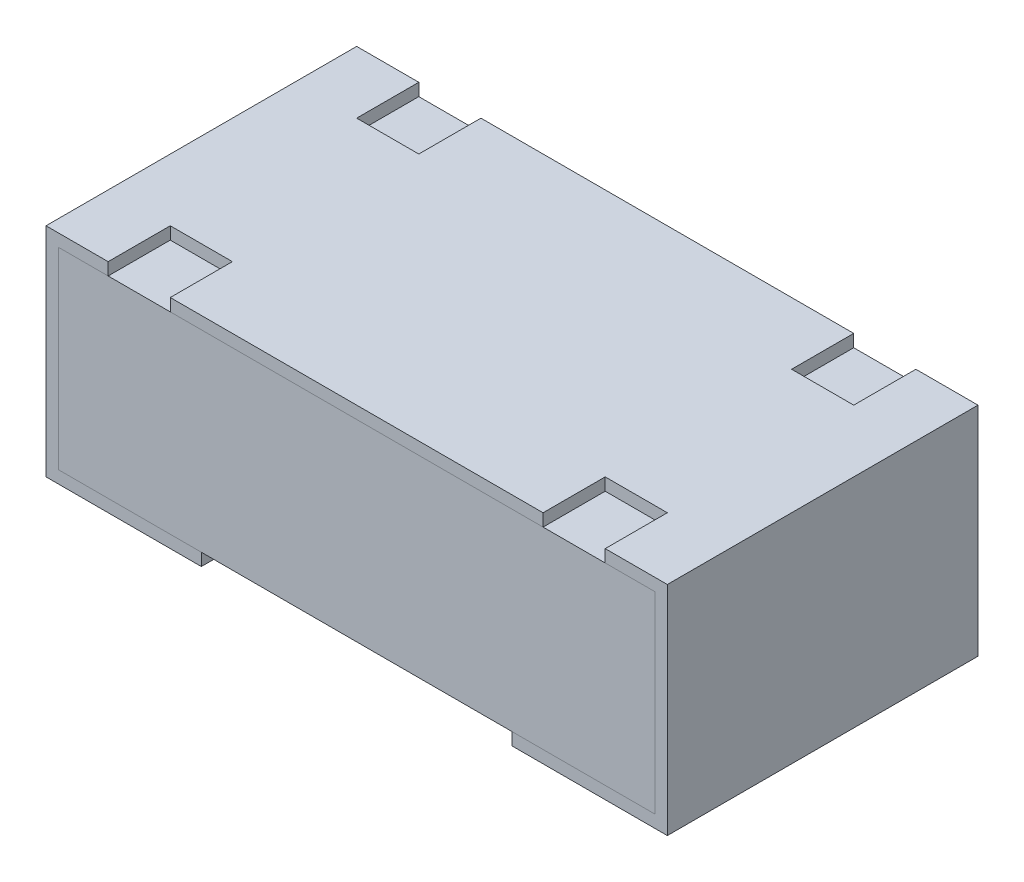
ISO-10303-21;
HEADER;
FILE_DESCRIPTION(('STEP AP214'),'2;1');
FILE_NAME('part.step','',(''),(''),'','','');
FILE_SCHEMA(('AUTOMOTIVE_DESIGN { 1 0 10303 214 1 1 1 1 }'));
ENDSEC;
DATA;
#1=APPLICATION_CONTEXT('core data for automotive mechanical design processes');
#2=APPLICATION_PROTOCOL_DEFINITION('international standard','automotive_design',2000,#1);
#3=PRODUCT_CONTEXT('',#1,'mechanical');
#4=PRODUCT('Part','Part','',(#3));
#5=PRODUCT_RELATED_PRODUCT_CATEGORY('part','',(#4));
#6=PRODUCT_DEFINITION_FORMATION('','',#4);
#7=PRODUCT_DEFINITION_CONTEXT('part definition',#1,'design');
#8=PRODUCT_DEFINITION('design','',#6,#7);
#9=PRODUCT_DEFINITION_SHAPE('','',#8);
#10=(LENGTH_UNIT() NAMED_UNIT(*) SI_UNIT(.MILLI.,.METRE.));
#11=(NAMED_UNIT(*) PLANE_ANGLE_UNIT() SI_UNIT($,.RADIAN.));
#12=(NAMED_UNIT(*) SI_UNIT($,.STERADIAN.) SOLID_ANGLE_UNIT());
#13=UNCERTAINTY_MEASURE_WITH_UNIT(LENGTH_MEASURE(1.E-05),#10,'distance_accuracy_value','');
#14=(GEOMETRIC_REPRESENTATION_CONTEXT(3) GLOBAL_UNCERTAINTY_ASSIGNED_CONTEXT((#13)) GLOBAL_UNIT_ASSIGNED_CONTEXT((#10,
#11,#12)) REPRESENTATION_CONTEXT('',''));
#15=CARTESIAN_POINT('',(0.,0.,0.));
#16=DIRECTION('',(0.,0.,1.));
#17=DIRECTION('',(1.,0.,0.));
#18=AXIS2_PLACEMENT_3D('',#15,#16,#17);
#19=CARTESIAN_POINT('',(-0.48,0.02,0.));
#20=DIRECTION('',(0.,0.,1.));
#21=DIRECTION('',(1.,0.,0.));
#22=AXIS2_PLACEMENT_3D('',#19,#20,#21);
#23=PLANE('',#22);
#24=DIRECTION('',(0.,-1.,0.));
#25=VECTOR('',#24,1.);
#26=CARTESIAN_POINT('',(-0.48,0.33,0.));
#27=LINE('',#26,#25);
#28=CARTESIAN_POINT('',(-0.48,0.33,0.));
#29=VERTEX_POINT('',#28);
#30=CARTESIAN_POINT('',(-0.48,0.02,0.));
#31=VERTEX_POINT('',#30);
#32=EDGE_CURVE('P0_E80',#29,#31,#27,.T.);
#33=ORIENTED_EDGE('',*,*,#32,.F.);
#34=DIRECTION('',(-1.,0.,0.));
#35=VECTOR('',#34,1.);
#36=CARTESIAN_POINT('',(-0.48,0.33,0.));
#37=LINE('',#36,#35);
#38=CARTESIAN_POINT('',(0.48,0.33,0.));
#39=VERTEX_POINT('',#38);
#40=EDGE_CURVE('P0_E26',#39,#29,#37,.T.);
#41=ORIENTED_EDGE('',*,*,#40,.F.);
#42=DIRECTION('',(0.,1.,0.));
#43=VECTOR('',#42,1.);
#44=CARTESIAN_POINT('',(0.48,0.33,0.));
#45=LINE('',#44,#43);
#46=CARTESIAN_POINT('',(0.48,0.02,0.));
#47=VERTEX_POINT('',#46);
#48=EDGE_CURVE('P0_E99',#47,#39,#45,.T.);
#49=ORIENTED_EDGE('',*,*,#48,.F.);
#50=DIRECTION('',(1.,0.,0.));
#51=VECTOR('',#50,1.);
#52=CARTESIAN_POINT('',(-0.48,0.02,0.));
#53=LINE('',#52,#51);
#54=EDGE_CURVE('P0_E84',#31,#47,#53,.T.);
#55=ORIENTED_EDGE('',*,*,#54,.F.);
#56=EDGE_LOOP('',(#33,#41,#49,#55));
#57=FACE_BOUND('',#56,.T.);
#58=ADVANCED_FACE('P0_F17',(#57),#23,.F.);
#59=CARTESIAN_POINT('',(-0.48,0.02,0.5));
#60=DIRECTION('',(0.,0.,1.));
#61=DIRECTION('',(1.,0.,0.));
#62=AXIS2_PLACEMENT_3D('',#59,#60,#61);
#63=PLANE('',#62);
#64=DIRECTION('',(0.,-1.,0.));
#65=VECTOR('',#64,1.);
#66=CARTESIAN_POINT('',(-0.48,0.33,0.5));
#67=LINE('',#66,#65);
#68=CARTESIAN_POINT('',(-0.48,0.33,0.5));
#69=VERTEX_POINT('',#68);
#70=CARTESIAN_POINT('',(-0.48,0.02,0.5));
#71=VERTEX_POINT('',#70);
#72=EDGE_CURVE('P0_E82',#69,#71,#67,.T.);
#73=ORIENTED_EDGE('',*,*,#72,.T.);
#74=DIRECTION('',(1.,0.,0.));
#75=VECTOR('',#74,1.);
#76=CARTESIAN_POINT('',(-0.48,0.02,0.5));
#77=LINE('',#76,#75);
#78=CARTESIAN_POINT('',(0.48,0.02,0.5));
#79=VERTEX_POINT('',#78);
#80=EDGE_CURVE('P0_E102',#71,#79,#77,.T.);
#81=ORIENTED_EDGE('',*,*,#80,.T.);
#82=DIRECTION('',(0.,1.,0.));
#83=VECTOR('',#82,1.);
#84=CARTESIAN_POINT('',(0.48,0.33,0.5));
#85=LINE('',#84,#83);
#86=CARTESIAN_POINT('',(0.48,0.33,0.5));
#87=VERTEX_POINT('',#86);
#88=EDGE_CURVE('P0_E75',#79,#87,#85,.T.);
#89=ORIENTED_EDGE('',*,*,#88,.T.);
#90=DIRECTION('',(-1.,0.,0.));
#91=VECTOR('',#90,1.);
#92=CARTESIAN_POINT('',(-0.48,0.33,0.5));
#93=LINE('',#92,#91);
#94=EDGE_CURVE('P0_E11',#87,#69,#93,.T.);
#95=ORIENTED_EDGE('',*,*,#94,.T.);
#96=EDGE_LOOP('',(#73,#81,#89,#95));
#97=FACE_BOUND('',#96,.T.);
#98=ADVANCED_FACE('P0_F19',(#97),#63,.T.);
#99=CARTESIAN_POINT('',(-0.48,0.33,0.5));
#100=DIRECTION('',(0.,-1.,0.));
#101=DIRECTION('',(0.,0.,-1.));
#102=AXIS2_PLACEMENT_3D('',#99,#100,#101);
#103=PLANE('',#102);
#104=ORIENTED_EDGE('',*,*,#40,.T.);
#105=DIRECTION('',(0.,0.,-1.));
#106=VECTOR('',#105,1.);
#107=CARTESIAN_POINT('',(-0.48,0.33,0.5));
#108=LINE('',#107,#106);
#109=EDGE_CURVE('P0_E69',#69,#29,#108,.T.);
#110=ORIENTED_EDGE('',*,*,#109,.F.);
#111=ORIENTED_EDGE('',*,*,#94,.F.);
#112=DIRECTION('',(0.,0.,-1.));
#113=VECTOR('',#112,1.);
#114=CARTESIAN_POINT('',(0.48,0.33,0.5));
#115=LINE('',#114,#113);
#116=EDGE_CURVE('P0_E72',#87,#39,#115,.T.);
#117=ORIENTED_EDGE('',*,*,#116,.T.);
#118=EDGE_LOOP('',(#104,#110,#111,#117));
#119=FACE_BOUND('',#118,.T.);
#120=ADVANCED_FACE('P0_F68',(#119),#103,.F.);
#121=CARTESIAN_POINT('',(0.48,0.33,0.5));
#122=DIRECTION('',(-1.,0.,0.));
#123=DIRECTION('',(0.,0.,1.));
#124=AXIS2_PLACEMENT_3D('',#121,#122,#123);
#125=PLANE('',#124);
#126=ORIENTED_EDGE('',*,*,#48,.T.);
#127=ORIENTED_EDGE('',*,*,#116,.F.);
#128=ORIENTED_EDGE('',*,*,#88,.F.);
#129=DIRECTION('',(0.,0.,-1.));
#130=VECTOR('',#129,1.);
#131=CARTESIAN_POINT('',(0.48,0.02,0.5));
#132=LINE('',#131,#130);
#133=EDGE_CURVE('P0_E105',#79,#47,#132,.T.);
#134=ORIENTED_EDGE('',*,*,#133,.T.);
#135=EDGE_LOOP('',(#126,#127,#128,#134));
#136=FACE_BOUND('',#135,.T.);
#137=ADVANCED_FACE('P0_F120',(#136),#125,.F.);
#138=CARTESIAN_POINT('',(-0.48,0.02,0.5));
#139=DIRECTION('',(0.,1.,0.));
#140=DIRECTION('',(1.,0.,0.));
#141=AXIS2_PLACEMENT_3D('',#138,#139,#140);
#142=PLANE('',#141);
#143=ORIENTED_EDGE('',*,*,#54,.T.);
#144=ORIENTED_EDGE('',*,*,#133,.F.);
#145=ORIENTED_EDGE('',*,*,#80,.F.);
#146=DIRECTION('',(0.,0.,-1.));
#147=VECTOR('',#146,1.);
#148=CARTESIAN_POINT('',(-0.48,0.02,0.5));
#149=LINE('',#148,#147);
#150=EDGE_CURVE('P0_E89',#71,#31,#149,.T.);
#151=ORIENTED_EDGE('',*,*,#150,.T.);
#152=EDGE_LOOP('',(#143,#144,#145,#151));
#153=FACE_BOUND('',#152,.T.);
#154=ADVANCED_FACE('P0_F122',(#153),#142,.F.);
#155=CARTESIAN_POINT('',(-0.48,0.33,0.5));
#156=DIRECTION('',(1.,0.,0.));
#157=DIRECTION('',(0.,1.,0.));
#158=AXIS2_PLACEMENT_3D('',#155,#156,#157);
#159=PLANE('',#158);
#160=ORIENTED_EDGE('',*,*,#32,.T.);
#161=ORIENTED_EDGE('',*,*,#150,.F.);
#162=ORIENTED_EDGE('',*,*,#72,.F.);
#163=ORIENTED_EDGE('',*,*,#109,.T.);
#164=EDGE_LOOP('',(#160,#161,#162,#163));
#165=FACE_BOUND('',#164,.T.);
#166=ADVANCED_FACE('P0_F78',(#165),#159,.F.);
#167=CLOSED_SHELL('',(#58,#98,#120,#137,#154,#166));
#168=MANIFOLD_SOLID_BREP('P0_B1',#167);
#169=CARTESIAN_POINT('',(-0.3,0.33,0.5));
#170=DIRECTION('',(1.,0.,0.));
#171=DIRECTION('',(0.,1.,0.));
#172=AXIS2_PLACEMENT_3D('',#169,#170,#171);
#173=PLANE('',#172);
#174=DIRECTION('',(0.,0.,-1.));
#175=VECTOR('',#174,1.);
#176=CARTESIAN_POINT('',(-0.3,0.35,0.5));
#177=LINE('',#176,#175);
#178=CARTESIAN_POINT('',(-0.3,0.35,0.5));
#179=VERTEX_POINT('',#178);
#180=CARTESIAN_POINT('',(-0.3,0.35,0.4));
#181=VERTEX_POINT('',#180);
#182=EDGE_CURVE('P1_E271',#179,#181,#177,.T.);
#183=ORIENTED_EDGE('',*,*,#182,.T.);
#184=DIRECTION('',(0.,1.,0.));
#185=VECTOR('',#184,1.);
#186=CARTESIAN_POINT('',(-0.3,0.33,0.4));
#187=LINE('',#186,#185);
#188=CARTESIAN_POINT('',(-0.3,0.33,0.4));
#189=VERTEX_POINT('',#188);
#190=EDGE_CURVE('P1_E11',#189,#181,#187,.T.);
#191=ORIENTED_EDGE('',*,*,#190,.F.);
#192=DIRECTION('',(0.,0.,-1.));
#193=VECTOR('',#192,1.);
#194=CARTESIAN_POINT('',(-0.3,0.33,0.5));
#195=LINE('',#194,#193);
#196=CARTESIAN_POINT('',(-0.3,0.33,0.5));
#197=VERTEX_POINT('',#196);
#198=EDGE_CURVE('P1_E273',#197,#189,#195,.T.);
#199=ORIENTED_EDGE('',*,*,#198,.F.);
#200=DIRECTION('',(0.,1.,0.));
#201=VECTOR('',#200,1.);
#202=CARTESIAN_POINT('',(-0.3,0.33,0.5));
#203=LINE('',#202,#201);
#204=EDGE_CURVE('P1_E268',#197,#179,#203,.T.);
#205=ORIENTED_EDGE('',*,*,#204,.T.);
#206=EDGE_LOOP('',(#183,#191,#199,#205));
#207=FACE_BOUND('',#206,.T.);
#208=ADVANCED_FACE('P1_F17',(#207),#173,.F.);
#209=CARTESIAN_POINT('',(-0.3,0.33,0.4));
#210=DIRECTION('',(0.,0.,-1.));
#211=DIRECTION('',(0.,-1.,0.));
#212=AXIS2_PLACEMENT_3D('',#209,#210,#211);
#213=PLANE('',#212);
#214=DIRECTION('',(-1.,0.,0.));
#215=VECTOR('',#214,1.);
#216=CARTESIAN_POINT('',(-0.3,0.35,0.4));
#217=LINE('',#216,#215);
#218=CARTESIAN_POINT('',(-0.4,0.35,0.4));
#219=VERTEX_POINT('',#218);
#220=EDGE_CURVE('P1_E294',#181,#219,#217,.T.);
#221=ORIENTED_EDGE('',*,*,#220,.T.);
#222=DIRECTION('',(0.,1.,0.));
#223=VECTOR('',#222,1.);
#224=CARTESIAN_POINT('',(-0.4,0.33,0.4));
#225=LINE('',#224,#223);
#226=CARTESIAN_POINT('',(-0.4,0.33,0.4));
#227=VERTEX_POINT('',#226);
#228=EDGE_CURVE('P1_E26',#227,#219,#225,.T.);
#229=ORIENTED_EDGE('',*,*,#228,.F.);
#230=DIRECTION('',(-1.,0.,0.));
#231=VECTOR('',#230,1.);
#232=CARTESIAN_POINT('',(-0.3,0.33,0.4));
#233=LINE('',#232,#231);
#234=EDGE_CURVE('P1_E342',#189,#227,#233,.T.);
#235=ORIENTED_EDGE('',*,*,#234,.F.);
#236=ORIENTED_EDGE('',*,*,#190,.T.);
#237=EDGE_LOOP('',(#221,#229,#235,#236));
#238=FACE_BOUND('',#237,.T.);
#239=ADVANCED_FACE('P1_F870',(#238),#213,.F.);
#240=CARTESIAN_POINT('',(-0.4,0.33,0.4));
#241=DIRECTION('',(-1.,0.,0.));
#242=DIRECTION('',(0.,0.,1.));
#243=AXIS2_PLACEMENT_3D('',#240,#241,#242);
#244=PLANE('',#243);
#245=DIRECTION('',(0.,0.,1.));
#246=VECTOR('',#245,1.);
#247=CARTESIAN_POINT('',(-0.4,0.35,0.4));
#248=LINE('',#247,#246);
#249=CARTESIAN_POINT('',(-0.4,0.35,0.5));
#250=VERTEX_POINT('',#249);
#251=EDGE_CURVE('P1_E312',#219,#250,#248,.T.);
#252=ORIENTED_EDGE('',*,*,#251,.T.);
#253=DIRECTION('',(0.,1.,0.));
#254=VECTOR('',#253,1.);
#255=CARTESIAN_POINT('',(-0.4,0.33,0.5));
#256=LINE('',#255,#254);
#257=CARTESIAN_POINT('',(-0.4,0.33,0.5));
#258=VERTEX_POINT('',#257);
#259=EDGE_CURVE('P1_E208',#258,#250,#256,.T.);
#260=ORIENTED_EDGE('',*,*,#259,.F.);
#261=DIRECTION('',(0.,0.,1.));
#262=VECTOR('',#261,1.);
#263=CARTESIAN_POINT('',(-0.4,0.33,0.4));
#264=LINE('',#263,#262);
#265=EDGE_CURVE('P1_E346',#227,#258,#264,.T.);
#266=ORIENTED_EDGE('',*,*,#265,.F.);
#267=ORIENTED_EDGE('',*,*,#228,.T.);
#268=EDGE_LOOP('',(#252,#260,#266,#267));
#269=FACE_BOUND('',#268,.T.);
#270=ADVANCED_FACE('P1_F867',(#269),#244,.F.);
#271=CARTESIAN_POINT('',(0.4,0.33,0.4));
#272=DIRECTION('',(1.,0.,0.));
#273=DIRECTION('',(0.,0.,-1.));
#274=AXIS2_PLACEMENT_3D('',#271,#272,#273);
#275=PLANE('',#274);
#276=DIRECTION('',(0.,0.,-1.));
#277=VECTOR('',#276,1.);
#278=CARTESIAN_POINT('',(0.4,0.35,0.4));
#279=LINE('',#278,#277);
#280=CARTESIAN_POINT('',(0.4,0.35,0.5));
#281=VERTEX_POINT('',#280);
#282=CARTESIAN_POINT('',(0.4,0.35,0.4));
#283=VERTEX_POINT('',#282);
#284=EDGE_CURVE('P1_E454',#281,#283,#279,.T.);
#285=ORIENTED_EDGE('',*,*,#284,.T.);
#286=DIRECTION('',(0.,1.,0.));
#287=VECTOR('',#286,1.);
#288=CARTESIAN_POINT('',(0.4,0.33,0.4));
#289=LINE('',#288,#287);
#290=CARTESIAN_POINT('',(0.4,0.33,0.4));
#291=VERTEX_POINT('',#290);
#292=EDGE_CURVE('P1_E349',#291,#283,#289,.T.);
#293=ORIENTED_EDGE('',*,*,#292,.F.);
#294=DIRECTION('',(0.,0.,-1.));
#295=VECTOR('',#294,1.);
#296=CARTESIAN_POINT('',(0.4,0.33,0.4));
#297=LINE('',#296,#295);
#298=CARTESIAN_POINT('',(0.4,0.33,0.5));
#299=VERTEX_POINT('',#298);
#300=EDGE_CURVE('P1_E483',#299,#291,#297,.T.);
#301=ORIENTED_EDGE('',*,*,#300,.F.);
#302=DIRECTION('',(0.,1.,0.));
#303=VECTOR('',#302,1.);
#304=CARTESIAN_POINT('',(0.4,0.33,0.5));
#305=LINE('',#304,#303);
#306=EDGE_CURVE('P1_E504',#299,#281,#305,.T.);
#307=ORIENTED_EDGE('',*,*,#306,.T.);
#308=EDGE_LOOP('',(#285,#293,#301,#307));
#309=FACE_BOUND('',#308,.T.);
#310=ADVANCED_FACE('P1_F19',(#309),#275,.F.);
#311=CARTESIAN_POINT('',(0.3,0.33,0.4));
#312=DIRECTION('',(0.,0.,-1.));
#313=DIRECTION('',(0.,-1.,0.));
#314=AXIS2_PLACEMENT_3D('',#311,#312,#313);
#315=PLANE('',#314);
#316=DIRECTION('',(-1.,0.,0.));
#317=VECTOR('',#316,1.);
#318=CARTESIAN_POINT('',(0.3,0.35,0.4));
#319=LINE('',#318,#317);
#320=CARTESIAN_POINT('',(0.3,0.35,0.4));
#321=VERTEX_POINT('',#320);
#322=EDGE_CURVE('P1_E451',#283,#321,#319,.T.);
#323=ORIENTED_EDGE('',*,*,#322,.T.);
#324=DIRECTION('',(0.,1.,0.));
#325=VECTOR('',#324,1.);
#326=CARTESIAN_POINT('',(0.3,0.33,0.4));
#327=LINE('',#326,#325);
#328=CARTESIAN_POINT('',(0.3,0.33,0.4));
#329=VERTEX_POINT('',#328);
#330=EDGE_CURVE('P1_E176',#329,#321,#327,.T.);
#331=ORIENTED_EDGE('',*,*,#330,.F.);
#332=DIRECTION('',(-1.,0.,0.));
#333=VECTOR('',#332,1.);
#334=CARTESIAN_POINT('',(0.3,0.33,0.4));
#335=LINE('',#334,#333);
#336=EDGE_CURVE('P1_E485',#291,#329,#335,.T.);
#337=ORIENTED_EDGE('',*,*,#336,.F.);
#338=ORIENTED_EDGE('',*,*,#292,.T.);
#339=EDGE_LOOP('',(#323,#331,#337,#338));
#340=FACE_BOUND('',#339,.T.);
#341=ADVANCED_FACE('P1_F855',(#340),#315,.F.);
#342=CARTESIAN_POINT('',(0.3,0.33,0.5));
#343=DIRECTION('',(-1.,0.,0.));
#344=DIRECTION('',(0.,0.,1.));
#345=AXIS2_PLACEMENT_3D('',#342,#343,#344);
#346=PLANE('',#345);
#347=DIRECTION('',(0.,0.,1.));
#348=VECTOR('',#347,1.);
#349=CARTESIAN_POINT('',(0.3,0.35,0.5));
#350=LINE('',#349,#348);
#351=CARTESIAN_POINT('',(0.3,0.35,0.5));
#352=VERTEX_POINT('',#351);
#353=EDGE_CURVE('P1_E290',#321,#352,#350,.T.);
#354=ORIENTED_EDGE('',*,*,#353,.T.);
#355=DIRECTION('',(0.,1.,0.));
#356=VECTOR('',#355,1.);
#357=CARTESIAN_POINT('',(0.3,0.33,0.5));
#358=LINE('',#357,#356);
#359=CARTESIAN_POINT('',(0.3,0.33,0.5));
#360=VERTEX_POINT('',#359);
#361=EDGE_CURVE('P1_E285',#360,#352,#358,.T.);
#362=ORIENTED_EDGE('',*,*,#361,.F.);
#363=DIRECTION('',(0.,0.,1.));
#364=VECTOR('',#363,1.);
#365=CARTESIAN_POINT('',(0.3,0.33,0.5));
#366=LINE('',#365,#364);
#367=EDGE_CURVE('P1_E447',#329,#360,#366,.T.);
#368=ORIENTED_EDGE('',*,*,#367,.F.);
#369=ORIENTED_EDGE('',*,*,#330,.T.);
#370=EDGE_LOOP('',(#354,#362,#368,#369));
#371=FACE_BOUND('',#370,.T.);
#372=ADVANCED_FACE('P1_F858',(#371),#346,.F.);
#373=CARTESIAN_POINT('',(-0.4,0.33,0.1));
#374=DIRECTION('',(-1.,0.,0.));
#375=DIRECTION('',(0.,1.,0.));
#376=AXIS2_PLACEMENT_3D('',#373,#374,#375);
#377=PLANE('',#376);
#378=DIRECTION('',(0.,0.,1.));
#379=VECTOR('',#378,1.);
#380=CARTESIAN_POINT('',(-0.4,0.35,0.1));
#381=LINE('',#380,#379);
#382=CARTESIAN_POINT('',(-0.4,0.35,0.));
#383=VERTEX_POINT('',#382);
#384=CARTESIAN_POINT('',(-0.4,0.35,0.1));
#385=VERTEX_POINT('',#384);
#386=EDGE_CURVE('P1_E332',#383,#385,#381,.T.);
#387=ORIENTED_EDGE('',*,*,#386,.T.);
#388=DIRECTION('',(0.,1.,0.));
#389=VECTOR('',#388,1.);
#390=CARTESIAN_POINT('',(-0.4,0.33,0.1));
#391=LINE('',#390,#389);
#392=CARTESIAN_POINT('',(-0.4,0.33,0.1));
#393=VERTEX_POINT('',#392);
#394=EDGE_CURVE('P1_E350',#393,#385,#391,.T.);
#395=ORIENTED_EDGE('',*,*,#394,.F.);
#396=DIRECTION('',(0.,0.,1.));
#397=VECTOR('',#396,1.);
#398=CARTESIAN_POINT('',(-0.4,0.33,0.1));
#399=LINE('',#398,#397);
#400=CARTESIAN_POINT('',(-0.4,0.33,0.));
#401=VERTEX_POINT('',#400);
#402=EDGE_CURVE('P1_E427',#401,#393,#399,.T.);
#403=ORIENTED_EDGE('',*,*,#402,.F.);
#404=DIRECTION('',(0.,1.,0.));
#405=VECTOR('',#404,1.);
#406=CARTESIAN_POINT('',(-0.4,0.33,0.));
#407=LINE('',#406,#405);
#408=EDGE_CURVE('P1_E507',#401,#383,#407,.T.);
#409=ORIENTED_EDGE('',*,*,#408,.T.);
#410=EDGE_LOOP('',(#387,#395,#403,#409));
#411=FACE_BOUND('',#410,.T.);
#412=ADVANCED_FACE('P1_F864',(#411),#377,.F.);
#413=CARTESIAN_POINT('',(-0.3,0.33,0.1));
#414=DIRECTION('',(0.,0.,1.));
#415=DIRECTION('',(1.,0.,0.));
#416=AXIS2_PLACEMENT_3D('',#413,#414,#415);
#417=PLANE('',#416);
#418=DIRECTION('',(1.,0.,0.));
#419=VECTOR('',#418,1.);
#420=CARTESIAN_POINT('',(-0.3,0.35,0.1));
#421=LINE('',#420,#419);
#422=CARTESIAN_POINT('',(-0.3,0.35,0.1));
#423=VERTEX_POINT('',#422);
#424=EDGE_CURVE('P1_E322',#385,#423,#421,.T.);
#425=ORIENTED_EDGE('',*,*,#424,.T.);
#426=DIRECTION('',(0.,1.,0.));
#427=VECTOR('',#426,1.);
#428=CARTESIAN_POINT('',(-0.3,0.33,0.1));
#429=LINE('',#428,#427);
#430=CARTESIAN_POINT('',(-0.3,0.33,0.1));
#431=VERTEX_POINT('',#430);
#432=EDGE_CURVE('P1_E516',#431,#423,#429,.T.);
#433=ORIENTED_EDGE('',*,*,#432,.F.);
#434=DIRECTION('',(1.,0.,0.));
#435=VECTOR('',#434,1.);
#436=CARTESIAN_POINT('',(-0.3,0.33,0.1));
#437=LINE('',#436,#435);
#438=EDGE_CURVE('P1_E398',#393,#431,#437,.T.);
#439=ORIENTED_EDGE('',*,*,#438,.F.);
#440=ORIENTED_EDGE('',*,*,#394,.T.);
#441=EDGE_LOOP('',(#425,#433,#439,#440));
#442=FACE_BOUND('',#441,.T.);
#443=ADVANCED_FACE('P1_F622',(#442),#417,.F.);
#444=CARTESIAN_POINT('',(-0.3,0.33,0.));
#445=DIRECTION('',(1.,0.,0.));
#446=DIRECTION('',(0.,1.,0.));
#447=AXIS2_PLACEMENT_3D('',#444,#445,#446);
#448=PLANE('',#447);
#449=DIRECTION('',(0.,0.,-1.));
#450=VECTOR('',#449,1.);
#451=CARTESIAN_POINT('',(-0.3,0.35,0.));
#452=LINE('',#451,#450);
#453=CARTESIAN_POINT('',(-0.3,0.35,0.));
#454=VERTEX_POINT('',#453);
#455=EDGE_CURVE('P1_E296',#423,#454,#452,.T.);
#456=ORIENTED_EDGE('',*,*,#455,.T.);
#457=DIRECTION('',(0.,1.,0.));
#458=VECTOR('',#457,1.);
#459=CARTESIAN_POINT('',(-0.3,0.33,0.));
#460=LINE('',#459,#458);
#461=CARTESIAN_POINT('',(-0.3,0.33,0.));
#462=VERTEX_POINT('',#461);
#463=EDGE_CURVE('P1_E392',#462,#454,#460,.T.);
#464=ORIENTED_EDGE('',*,*,#463,.F.);
#465=DIRECTION('',(0.,0.,-1.));
#466=VECTOR('',#465,1.);
#467=CARTESIAN_POINT('',(-0.3,0.33,0.));
#468=LINE('',#467,#466);
#469=EDGE_CURVE('P1_E307',#431,#462,#468,.T.);
#470=ORIENTED_EDGE('',*,*,#469,.F.);
#471=ORIENTED_EDGE('',*,*,#432,.T.);
#472=EDGE_LOOP('',(#456,#464,#470,#471));
#473=FACE_BOUND('',#472,.T.);
#474=ADVANCED_FACE('P1_F625',(#473),#448,.F.);
#475=CARTESIAN_POINT('',(0.3,0.33,0.));
#476=DIRECTION('',(-1.,0.,0.));
#477=DIRECTION('',(0.,0.,1.));
#478=AXIS2_PLACEMENT_3D('',#475,#476,#477);
#479=PLANE('',#478);
#480=DIRECTION('',(0.,0.,1.));
#481=VECTOR('',#480,1.);
#482=CARTESIAN_POINT('',(0.3,0.35,0.));
#483=LINE('',#482,#481);
#484=CARTESIAN_POINT('',(0.3,0.35,0.));
#485=VERTEX_POINT('',#484);
#486=CARTESIAN_POINT('',(0.3,0.35,0.1));
#487=VERTEX_POINT('',#486);
#488=EDGE_CURVE('P1_E568',#485,#487,#483,.T.);
#489=ORIENTED_EDGE('',*,*,#488,.T.);
#490=DIRECTION('',(0.,1.,0.));
#491=VECTOR('',#490,1.);
#492=CARTESIAN_POINT('',(0.3,0.33,0.1));
#493=LINE('',#492,#491);
#494=CARTESIAN_POINT('',(0.3,0.33,0.1));
#495=VERTEX_POINT('',#494);
#496=EDGE_CURVE('P1_E513',#495,#487,#493,.T.);
#497=ORIENTED_EDGE('',*,*,#496,.F.);
#498=DIRECTION('',(0.,0.,1.));
#499=VECTOR('',#498,1.);
#500=CARTESIAN_POINT('',(0.3,0.33,0.));
#501=LINE('',#500,#499);
#502=CARTESIAN_POINT('',(0.3,0.33,0.));
#503=VERTEX_POINT('',#502);
#504=EDGE_CURVE('P1_E474',#503,#495,#501,.T.);
#505=ORIENTED_EDGE('',*,*,#504,.F.);
#506=DIRECTION('',(0.,1.,0.));
#507=VECTOR('',#506,1.);
#508=CARTESIAN_POINT('',(0.3,0.33,0.));
#509=LINE('',#508,#507);
#510=EDGE_CURVE('P1_E393',#503,#485,#509,.T.);
#511=ORIENTED_EDGE('',*,*,#510,.T.);
#512=EDGE_LOOP('',(#489,#497,#505,#511));
#513=FACE_BOUND('',#512,.T.);
#514=ADVANCED_FACE('P1_F887',(#513),#479,.F.);
#515=CARTESIAN_POINT('',(0.3,0.33,0.1));
#516=DIRECTION('',(0.,0.,1.));
#517=DIRECTION('',(1.,0.,0.));
#518=AXIS2_PLACEMENT_3D('',#515,#516,#517);
#519=PLANE('',#518);
#520=DIRECTION('',(1.,0.,0.));
#521=VECTOR('',#520,1.);
#522=CARTESIAN_POINT('',(0.3,0.35,0.1));
#523=LINE('',#522,#521);
#524=CARTESIAN_POINT('',(0.4,0.35,0.1));
#525=VERTEX_POINT('',#524);
#526=EDGE_CURVE('P1_E444',#487,#525,#523,.T.);
#527=ORIENTED_EDGE('',*,*,#526,.T.);
#528=DIRECTION('',(0.,1.,0.));
#529=VECTOR('',#528,1.);
#530=CARTESIAN_POINT('',(0.4,0.33,0.1));
#531=LINE('',#530,#529);
#532=CARTESIAN_POINT('',(0.4,0.33,0.1));
#533=VERTEX_POINT('',#532);
#534=EDGE_CURVE('P1_E510',#533,#525,#531,.T.);
#535=ORIENTED_EDGE('',*,*,#534,.F.);
#536=DIRECTION('',(1.,0.,0.));
#537=VECTOR('',#536,1.);
#538=CARTESIAN_POINT('',(0.3,0.33,0.1));
#539=LINE('',#538,#537);
#540=EDGE_CURVE('P1_E478',#495,#533,#539,.T.);
#541=ORIENTED_EDGE('',*,*,#540,.F.);
#542=ORIENTED_EDGE('',*,*,#496,.T.);
#543=EDGE_LOOP('',(#527,#535,#541,#542));
#544=FACE_BOUND('',#543,.T.);
#545=ADVANCED_FACE('P1_F835',(#544),#519,.F.);
#546=CARTESIAN_POINT('',(0.4,0.33,0.1));
#547=DIRECTION('',(1.,0.,0.));
#548=DIRECTION('',(0.,0.,1.));
#549=AXIS2_PLACEMENT_3D('',#546,#547,#548);
#550=PLANE('',#549);
#551=DIRECTION('',(0.,0.,-1.));
#552=VECTOR('',#551,1.);
#553=CARTESIAN_POINT('',(0.4,0.35,0.1));
#554=LINE('',#553,#552);
#555=CARTESIAN_POINT('',(0.4,0.35,0.));
#556=VERTEX_POINT('',#555);
#557=EDGE_CURVE('P1_E406',#525,#556,#554,.T.);
#558=ORIENTED_EDGE('',*,*,#557,.T.);
#559=DIRECTION('',(0.,1.,0.));
#560=VECTOR('',#559,1.);
#561=CARTESIAN_POINT('',(0.4,0.33,0.));
#562=LINE('',#561,#560);
#563=CARTESIAN_POINT('',(0.4,0.33,0.));
#564=VERTEX_POINT('',#563);
#565=EDGE_CURVE('P1_E319',#564,#556,#562,.T.);
#566=ORIENTED_EDGE('',*,*,#565,.F.);
#567=DIRECTION('',(0.,0.,-1.));
#568=VECTOR('',#567,1.);
#569=CARTESIAN_POINT('',(0.4,0.33,0.1));
#570=LINE('',#569,#568);
#571=EDGE_CURVE('P1_E547',#533,#564,#570,.T.);
#572=ORIENTED_EDGE('',*,*,#571,.F.);
#573=ORIENTED_EDGE('',*,*,#534,.T.);
#574=EDGE_LOOP('',(#558,#566,#572,#573));
#575=FACE_BOUND('',#574,.T.);
#576=ADVANCED_FACE('P1_F838',(#575),#550,.F.);
#577=CARTESIAN_POINT('',(0.25,0.,0.));
#578=DIRECTION('',(0.,0.,1.));
#579=DIRECTION('',(1.,0.,0.));
#580=AXIS2_PLACEMENT_3D('',#577,#578,#579);
#581=PLANE('',#580);
#582=DIRECTION('',(-1.,0.,0.));
#583=VECTOR('',#582,1.);
#584=CARTESIAN_POINT('',(0.,0.35,0.));
#585=LINE('',#584,#583);
#586=CARTESIAN_POINT('',(-0.5,0.35,0.));
#587=VERTEX_POINT('',#586);
#588=EDGE_CURVE('P1_E336',#383,#587,#585,.T.);
#589=ORIENTED_EDGE('',*,*,#588,.F.);
#590=ORIENTED_EDGE('',*,*,#408,.F.);
#591=DIRECTION('',(1.,0.,0.));
#592=VECTOR('',#591,1.);
#593=CARTESIAN_POINT('',(0.,0.33,0.));
#594=LINE('',#593,#592);
#595=CARTESIAN_POINT('',(-0.48,0.33,0.));
#596=VERTEX_POINT('',#595);
#597=EDGE_CURVE('P1_E473',#596,#401,#594,.T.);
#598=ORIENTED_EDGE('',*,*,#597,.F.);
#599=DIRECTION('',(0.,1.,0.));
#600=VECTOR('',#599,1.);
#601=CARTESIAN_POINT('',(-0.48,0.33,0.));
#602=LINE('',#601,#600);
#603=CARTESIAN_POINT('',(-0.48,0.02,0.));
#604=VERTEX_POINT('',#603);
#605=EDGE_CURVE('P1_E470',#604,#596,#602,.T.);
#606=ORIENTED_EDGE('',*,*,#605,.F.);
#607=DIRECTION('',(-1.,0.,0.));
#608=VECTOR('',#607,1.);
#609=CARTESIAN_POINT('',(-0.48,0.02,0.));
#610=LINE('',#609,#608);
#611=CARTESIAN_POINT('',(-0.25,0.02,0.));
#612=VERTEX_POINT('',#611);
#613=EDGE_CURVE('P1_E371',#612,#604,#610,.T.);
#614=ORIENTED_EDGE('',*,*,#613,.F.);
#615=DIRECTION('',(0.,1.,0.));
#616=VECTOR('',#615,1.);
#617=CARTESIAN_POINT('',(-0.25,0.02,0.));
#618=LINE('',#617,#616);
#619=CARTESIAN_POINT('',(-0.25,0.,0.));
#620=VERTEX_POINT('',#619);
#621=EDGE_CURVE('P1_E416',#620,#612,#618,.T.);
#622=ORIENTED_EDGE('',*,*,#621,.F.);
#623=DIRECTION('',(1.,0.,0.));
#624=VECTOR('',#623,1.);
#625=CARTESIAN_POINT('',(-0.5,0.,0.));
#626=LINE('',#625,#624);
#627=CARTESIAN_POINT('',(-0.5,0.,0.));
#628=VERTEX_POINT('',#627);
#629=EDGE_CURVE('P1_E355',#628,#620,#626,.T.);
#630=ORIENTED_EDGE('',*,*,#629,.F.);
#631=DIRECTION('',(0.,-1.,0.));
#632=VECTOR('',#631,1.);
#633=CARTESIAN_POINT('',(-0.5,0.35,0.));
#634=LINE('',#633,#632);
#635=EDGE_CURVE('P1_E356',#587,#628,#634,.T.);
#636=ORIENTED_EDGE('',*,*,#635,.F.);
#637=EDGE_LOOP('',(#589,#590,#598,#606,#614,#622,#630,#636));
#638=FACE_BOUND('',#637,.T.);
#639=ADVANCED_FACE('P1_F614',(#638),#581,.F.);
#640=CARTESIAN_POINT('',(0.25,0.,0.5));
#641=DIRECTION('',(0.,0.,1.));
#642=DIRECTION('',(1.,0.,0.));
#643=AXIS2_PLACEMENT_3D('',#640,#641,#642);
#644=PLANE('',#643);
#645=ORIENTED_EDGE('',*,*,#306,.F.);
#646=DIRECTION('',(1.,0.,0.));
#647=VECTOR('',#646,1.);
#648=CARTESIAN_POINT('',(0.,0.33,0.5));
#649=LINE('',#648,#647);
#650=CARTESIAN_POINT('',(0.48,0.33,0.5));
#651=VERTEX_POINT('',#650);
#652=EDGE_CURVE('P1_E479',#299,#651,#649,.T.);
#653=ORIENTED_EDGE('',*,*,#652,.T.);
#654=DIRECTION('',(0.,-1.,0.));
#655=VECTOR('',#654,1.);
#656=CARTESIAN_POINT('',(0.48,0.33,0.5));
#657=LINE('',#656,#655);
#658=CARTESIAN_POINT('',(0.48,0.02,0.5));
#659=VERTEX_POINT('',#658);
#660=EDGE_CURVE('P1_E426',#651,#659,#657,.T.);
#661=ORIENTED_EDGE('',*,*,#660,.T.);
#662=DIRECTION('',(-1.,0.,0.));
#663=VECTOR('',#662,1.);
#664=CARTESIAN_POINT('',(0.48,0.02,0.5));
#665=LINE('',#664,#663);
#666=CARTESIAN_POINT('',(0.25,0.02,0.5));
#667=VERTEX_POINT('',#666);
#668=EDGE_CURVE('P1_E50',#659,#667,#665,.T.);
#669=ORIENTED_EDGE('',*,*,#668,.T.);
#670=DIRECTION('',(0.,-1.,0.));
#671=VECTOR('',#670,1.);
#672=CARTESIAN_POINT('',(0.25,0.02,0.5));
#673=LINE('',#672,#671);
#674=CARTESIAN_POINT('',(0.25,0.,0.5));
#675=VERTEX_POINT('',#674);
#676=EDGE_CURVE('P1_E38',#667,#675,#673,.T.);
#677=ORIENTED_EDGE('',*,*,#676,.T.);
#678=DIRECTION('',(1.,0.,0.));
#679=VECTOR('',#678,1.);
#680=CARTESIAN_POINT('',(0.5,0.,0.5));
#681=LINE('',#680,#679);
#682=CARTESIAN_POINT('',(0.5,0.,0.5));
#683=VERTEX_POINT('',#682);
#684=EDGE_CURVE('P1_E430',#675,#683,#681,.T.);
#685=ORIENTED_EDGE('',*,*,#684,.T.);
#686=DIRECTION('',(0.,1.,0.));
#687=VECTOR('',#686,1.);
#688=CARTESIAN_POINT('',(0.5,0.35,0.5));
#689=LINE('',#688,#687);
#690=CARTESIAN_POINT('',(0.5,0.35,0.5));
#691=VERTEX_POINT('',#690);
#692=EDGE_CURVE('P1_E440',#683,#691,#689,.T.);
#693=ORIENTED_EDGE('',*,*,#692,.T.);
#694=DIRECTION('',(-1.,0.,0.));
#695=VECTOR('',#694,1.);
#696=CARTESIAN_POINT('',(0.,0.35,0.5));
#697=LINE('',#696,#695);
#698=EDGE_CURVE('P1_E409',#691,#281,#697,.T.);
#699=ORIENTED_EDGE('',*,*,#698,.T.);
#700=EDGE_LOOP('',(#645,#653,#661,#669,#677,#685,#693,#699));
#701=FACE_BOUND('',#700,.T.);
#702=ADVANCED_FACE('P1_F851',(#701),#644,.T.);
#703=CARTESIAN_POINT('',(0.25,0.02,0.5));
#704=DIRECTION('',(1.,0.,0.));
#705=DIRECTION('',(0.,1.,0.));
#706=AXIS2_PLACEMENT_3D('',#703,#704,#705);
#707=PLANE('',#706);
#708=DIRECTION('',(0.,-1.,0.));
#709=VECTOR('',#708,1.);
#710=CARTESIAN_POINT('',(0.25,0.02,0.));
#711=LINE('',#710,#709);
#712=CARTESIAN_POINT('',(0.25,0.02,0.));
#713=VERTEX_POINT('',#712);
#714=CARTESIAN_POINT('',(0.25,0.,0.));
#715=VERTEX_POINT('',#714);
#716=EDGE_CURVE('P1_E384',#713,#715,#711,.T.);
#717=ORIENTED_EDGE('',*,*,#716,.T.);
#718=DIRECTION('',(0.,0.,-1.));
#719=VECTOR('',#718,1.);
#720=CARTESIAN_POINT('',(0.25,0.,0.5));
#721=LINE('',#720,#719);
#722=EDGE_CURVE('P1_E434',#675,#715,#721,.T.);
#723=ORIENTED_EDGE('',*,*,#722,.F.);
#724=ORIENTED_EDGE('',*,*,#676,.F.);
#725=DIRECTION('',(0.,0.,-1.));
#726=VECTOR('',#725,1.);
#727=CARTESIAN_POINT('',(0.25,0.02,0.5));
#728=LINE('',#727,#726);
#729=EDGE_CURVE('P1_E497',#667,#713,#728,.T.);
#730=ORIENTED_EDGE('',*,*,#729,.T.);
#731=EDGE_LOOP('',(#717,#723,#724,#730));
#732=FACE_BOUND('',#731,.T.);
#733=ADVANCED_FACE('P1_F922',(#732),#707,.F.);
#734=CARTESIAN_POINT('',(0.48,0.02,0.5));
#735=DIRECTION('',(0.,-1.,0.));
#736=DIRECTION('',(0.,0.,-1.));
#737=AXIS2_PLACEMENT_3D('',#734,#735,#736);
#738=PLANE('',#737);
#739=DIRECTION('',(-1.,0.,0.));
#740=VECTOR('',#739,1.);
#741=CARTESIAN_POINT('',(0.48,0.02,0.));
#742=LINE('',#741,#740);
#743=CARTESIAN_POINT('',(0.48,0.02,0.));
#744=VERTEX_POINT('',#743);
#745=EDGE_CURVE('P1_E328',#744,#713,#742,.T.);
#746=ORIENTED_EDGE('',*,*,#745,.T.);
#747=ORIENTED_EDGE('',*,*,#729,.F.);
#748=ORIENTED_EDGE('',*,*,#668,.F.);
#749=DIRECTION('',(0.,0.,-1.));
#750=VECTOR('',#749,1.);
#751=CARTESIAN_POINT('',(0.48,0.02,0.5));
#752=LINE('',#751,#750);
#753=EDGE_CURVE('P1_E423',#659,#744,#752,.T.);
#754=ORIENTED_EDGE('',*,*,#753,.T.);
#755=EDGE_LOOP('',(#746,#747,#748,#754));
#756=FACE_BOUND('',#755,.T.);
#757=ADVANCED_FACE('P1_F919',(#756),#738,.F.);
#758=CARTESIAN_POINT('',(0.48,0.33,0.5));
#759=DIRECTION('',(1.,0.,0.));
#760=DIRECTION('',(0.,1.,0.));
#761=AXIS2_PLACEMENT_3D('',#758,#759,#760);
#762=PLANE('',#761);
#763=DIRECTION('',(0.,-1.,0.));
#764=VECTOR('',#763,1.);
#765=CARTESIAN_POINT('',(0.48,0.33,0.));
#766=LINE('',#765,#764);
#767=CARTESIAN_POINT('',(0.48,0.33,0.));
#768=VERTEX_POINT('',#767);
#769=EDGE_CURVE('P1_E323',#768,#744,#766,.T.);
#770=ORIENTED_EDGE('',*,*,#769,.T.);
#771=ORIENTED_EDGE('',*,*,#753,.F.);
#772=ORIENTED_EDGE('',*,*,#660,.F.);
#773=DIRECTION('',(0.,0.,-1.));
#774=VECTOR('',#773,1.);
#775=CARTESIAN_POINT('',(0.48,0.33,0.5));
#776=LINE('',#775,#774);
#777=EDGE_CURVE('P1_E484',#651,#768,#776,.T.);
#778=ORIENTED_EDGE('',*,*,#777,.T.);
#779=EDGE_LOOP('',(#770,#771,#772,#778));
#780=FACE_BOUND('',#779,.T.);
#781=ADVANCED_FACE('P1_F848',(#780),#762,.F.);
#782=CARTESIAN_POINT('',(0.,0.33,0.5));
#783=DIRECTION('',(0.,1.,0.));
#784=DIRECTION('',(1.,0.,0.));
#785=AXIS2_PLACEMENT_3D('',#782,#783,#784);
#786=PLANE('',#785);
#787=ORIENTED_EDGE('',*,*,#438,.T.);
#788=ORIENTED_EDGE('',*,*,#469,.T.);
#789=DIRECTION('',(1.,0.,0.));
#790=VECTOR('',#789,1.);
#791=CARTESIAN_POINT('',(0.,0.33,0.));
#792=LINE('',#791,#790);
#793=EDGE_CURVE('P1_E379',#462,#503,#792,.T.);
#794=ORIENTED_EDGE('',*,*,#793,.T.);
#795=ORIENTED_EDGE('',*,*,#504,.T.);
#796=ORIENTED_EDGE('',*,*,#540,.T.);
#797=ORIENTED_EDGE('',*,*,#571,.T.);
#798=DIRECTION('',(1.,0.,0.));
#799=VECTOR('',#798,1.);
#800=CARTESIAN_POINT('',(0.,0.33,0.));
#801=LINE('',#800,#799);
#802=EDGE_CURVE('P1_E397',#564,#768,#801,.T.);
#803=ORIENTED_EDGE('',*,*,#802,.T.);
#804=ORIENTED_EDGE('',*,*,#777,.F.);
#805=ORIENTED_EDGE('',*,*,#652,.F.);
#806=ORIENTED_EDGE('',*,*,#300,.T.);
#807=ORIENTED_EDGE('',*,*,#336,.T.);
#808=ORIENTED_EDGE('',*,*,#367,.T.);
#809=DIRECTION('',(1.,0.,0.));
#810=VECTOR('',#809,1.);
#811=CARTESIAN_POINT('',(0.,0.33,0.5));
#812=LINE('',#811,#810);
#813=EDGE_CURVE('P1_E278',#197,#360,#812,.T.);
#814=ORIENTED_EDGE('',*,*,#813,.F.);
#815=ORIENTED_EDGE('',*,*,#198,.T.);
#816=ORIENTED_EDGE('',*,*,#234,.T.);
#817=ORIENTED_EDGE('',*,*,#265,.T.);
#818=DIRECTION('',(1.,0.,0.));
#819=VECTOR('',#818,1.);
#820=CARTESIAN_POINT('',(0.,0.33,0.5));
#821=LINE('',#820,#819);
#822=CARTESIAN_POINT('',(-0.48,0.33,0.5));
#823=VERTEX_POINT('',#822);
#824=EDGE_CURVE('P1_E279',#823,#258,#821,.T.);
#825=ORIENTED_EDGE('',*,*,#824,.F.);
#826=DIRECTION('',(0.,0.,-1.));
#827=VECTOR('',#826,1.);
#828=CARTESIAN_POINT('',(-0.48,0.33,0.5));
#829=LINE('',#828,#827);
#830=EDGE_CURVE('P1_E402',#823,#596,#829,.T.);
#831=ORIENTED_EDGE('',*,*,#830,.T.);
#832=ORIENTED_EDGE('',*,*,#597,.T.);
#833=ORIENTED_EDGE('',*,*,#402,.T.);
#834=EDGE_LOOP('',(#787,#788,#794,#795,#796,#797,#803,#804,#805,#806,#807,#808,#814,#815,#816,
#817,#825,#831,#832,#833));
#835=FACE_BOUND('',#834,.T.);
#836=ADVANCED_FACE('P1_F605',(#835),#786,.F.);
#837=CARTESIAN_POINT('',(-0.48,0.33,0.5));
#838=DIRECTION('',(-1.,0.,0.));
#839=DIRECTION('',(0.,0.,1.));
#840=AXIS2_PLACEMENT_3D('',#837,#838,#839);
#841=PLANE('',#840);
#842=ORIENTED_EDGE('',*,*,#605,.T.);
#843=ORIENTED_EDGE('',*,*,#830,.F.);
#844=DIRECTION('',(0.,1.,0.));
#845=VECTOR('',#844,1.);
#846=CARTESIAN_POINT('',(-0.48,0.33,0.5));
#847=LINE('',#846,#845);
#848=CARTESIAN_POINT('',(-0.48,0.02,0.5));
#849=VERTEX_POINT('',#848);
#850=EDGE_CURVE('P1_E364',#849,#823,#847,.T.);
#851=ORIENTED_EDGE('',*,*,#850,.F.);
#852=DIRECTION('',(0.,0.,-1.));
#853=VECTOR('',#852,1.);
#854=CARTESIAN_POINT('',(-0.48,0.02,0.5));
#855=LINE('',#854,#853);
#856=EDGE_CURVE('P1_E375',#849,#604,#855,.T.);
#857=ORIENTED_EDGE('',*,*,#856,.T.);
#858=EDGE_LOOP('',(#842,#843,#851,#857));
#859=FACE_BOUND('',#858,.T.);
#860=ADVANCED_FACE('P1_F603',(#859),#841,.F.);
#861=CARTESIAN_POINT('',(-0.48,0.02,0.5));
#862=DIRECTION('',(0.,-1.,0.));
#863=DIRECTION('',(0.,0.,-1.));
#864=AXIS2_PLACEMENT_3D('',#861,#862,#863);
#865=PLANE('',#864);
#866=ORIENTED_EDGE('',*,*,#613,.T.);
#867=ORIENTED_EDGE('',*,*,#856,.F.);
#868=DIRECTION('',(-1.,0.,0.));
#869=VECTOR('',#868,1.);
#870=CARTESIAN_POINT('',(-0.48,0.02,0.5));
#871=LINE('',#870,#869);
#872=CARTESIAN_POINT('',(-0.25,0.02,0.5));
#873=VERTEX_POINT('',#872);
#874=EDGE_CURVE('P1_E360',#873,#849,#871,.T.);
#875=ORIENTED_EDGE('',*,*,#874,.F.);
#876=DIRECTION('',(0.,0.,-1.));
#877=VECTOR('',#876,1.);
#878=CARTESIAN_POINT('',(-0.25,0.02,0.5));
#879=LINE('',#878,#877);
#880=EDGE_CURVE('P1_E376',#873,#612,#879,.T.);
#881=ORIENTED_EDGE('',*,*,#880,.T.);
#882=EDGE_LOOP('',(#866,#867,#875,#881));
#883=FACE_BOUND('',#882,.T.);
#884=ADVANCED_FACE('P1_F611',(#883),#865,.F.);
#885=CARTESIAN_POINT('',(-0.25,0.02,0.5));
#886=DIRECTION('',(-1.,0.,0.));
#887=DIRECTION('',(0.,0.,1.));
#888=AXIS2_PLACEMENT_3D('',#885,#886,#887);
#889=PLANE('',#888);
#890=ORIENTED_EDGE('',*,*,#621,.T.);
#891=ORIENTED_EDGE('',*,*,#880,.F.);
#892=DIRECTION('',(0.,1.,0.));
#893=VECTOR('',#892,1.);
#894=CARTESIAN_POINT('',(-0.25,0.02,0.5));
#895=LINE('',#894,#893);
#896=CARTESIAN_POINT('',(-0.25,0.,0.5));
#897=VERTEX_POINT('',#896);
#898=EDGE_CURVE('P1_E365',#897,#873,#895,.T.);
#899=ORIENTED_EDGE('',*,*,#898,.F.);
#900=DIRECTION('',(0.,0.,-1.));
#901=VECTOR('',#900,1.);
#902=CARTESIAN_POINT('',(-0.25,0.,0.5));
#903=LINE('',#902,#901);
#904=EDGE_CURVE('P1_E388',#897,#620,#903,.T.);
#905=ORIENTED_EDGE('',*,*,#904,.T.);
#906=EDGE_LOOP('',(#890,#891,#899,#905));
#907=FACE_BOUND('',#906,.T.);
#908=ADVANCED_FACE('P1_F906',(#907),#889,.F.);
#909=CARTESIAN_POINT('',(-0.5,0.,0.5));
#910=DIRECTION('',(0.,1.,0.));
#911=DIRECTION('',(1.,0.,0.));
#912=AXIS2_PLACEMENT_3D('',#909,#910,#911);
#913=PLANE('',#912);
#914=ORIENTED_EDGE('',*,*,#629,.T.);
#915=ORIENTED_EDGE('',*,*,#904,.F.);
#916=DIRECTION('',(1.,0.,0.));
#917=VECTOR('',#916,1.);
#918=CARTESIAN_POINT('',(-0.5,0.,0.5));
#919=LINE('',#918,#917);
#920=CARTESIAN_POINT('',(-0.5,0.,0.5));
#921=VERTEX_POINT('',#920);
#922=EDGE_CURVE('P1_E538',#921,#897,#919,.T.);
#923=ORIENTED_EDGE('',*,*,#922,.F.);
#924=DIRECTION('',(0.,0.,-1.));
#925=VECTOR('',#924,1.);
#926=CARTESIAN_POINT('',(-0.5,0.,0.5));
#927=LINE('',#926,#925);
#928=EDGE_CURVE('P1_E351',#921,#628,#927,.T.);
#929=ORIENTED_EDGE('',*,*,#928,.T.);
#930=EDGE_LOOP('',(#914,#915,#923,#929));
#931=FACE_BOUND('',#930,.T.);
#932=ADVANCED_FACE('P1_F902',(#931),#913,.F.);
#933=CARTESIAN_POINT('',(-0.5,0.35,0.5));
#934=DIRECTION('',(1.,0.,0.));
#935=DIRECTION('',(0.,1.,0.));
#936=AXIS2_PLACEMENT_3D('',#933,#934,#935);
#937=PLANE('',#936);
#938=ORIENTED_EDGE('',*,*,#635,.T.);
#939=ORIENTED_EDGE('',*,*,#928,.F.);
#940=DIRECTION('',(0.,-1.,0.));
#941=VECTOR('',#940,1.);
#942=CARTESIAN_POINT('',(-0.5,0.35,0.5));
#943=LINE('',#942,#941);
#944=CARTESIAN_POINT('',(-0.5,0.35,0.5));
#945=VERTEX_POINT('',#944);
#946=EDGE_CURVE('P1_E359',#945,#921,#943,.T.);
#947=ORIENTED_EDGE('',*,*,#946,.F.);
#948=DIRECTION('',(0.,0.,-1.));
#949=VECTOR('',#948,1.);
#950=CARTESIAN_POINT('',(-0.5,0.35,0.5));
#951=LINE('',#950,#949);
#952=EDGE_CURVE('P1_E313',#945,#587,#951,.T.);
#953=ORIENTED_EDGE('',*,*,#952,.T.);
#954=EDGE_LOOP('',(#938,#939,#947,#953));
#955=FACE_BOUND('',#954,.T.);
#956=ADVANCED_FACE('P1_F890',(#955),#937,.F.);
#957=CARTESIAN_POINT('',(0.5,0.35,0.5));
#958=DIRECTION('',(-1.,0.,0.));
#959=DIRECTION('',(0.,0.,1.));
#960=AXIS2_PLACEMENT_3D('',#957,#958,#959);
#961=PLANE('',#960);
#962=DIRECTION('',(0.,1.,0.));
#963=VECTOR('',#962,1.);
#964=CARTESIAN_POINT('',(0.5,0.35,0.));
#965=LINE('',#964,#963);
#966=CARTESIAN_POINT('',(0.5,0.,0.));
#967=VERTEX_POINT('',#966);
#968=CARTESIAN_POINT('',(0.5,0.35,0.));
#969=VERTEX_POINT('',#968);
#970=EDGE_CURVE('P1_E318',#967,#969,#965,.T.);
#971=ORIENTED_EDGE('',*,*,#970,.T.);
#972=DIRECTION('',(0.,0.,-1.));
#973=VECTOR('',#972,1.);
#974=CARTESIAN_POINT('',(0.5,0.35,0.5));
#975=LINE('',#974,#973);
#976=EDGE_CURVE('P1_E437',#691,#969,#975,.T.);
#977=ORIENTED_EDGE('',*,*,#976,.F.);
#978=ORIENTED_EDGE('',*,*,#692,.F.);
#979=DIRECTION('',(0.,0.,-1.));
#980=VECTOR('',#979,1.);
#981=CARTESIAN_POINT('',(0.5,0.,0.5));
#982=LINE('',#981,#980);
#983=EDGE_CURVE('P1_E327',#683,#967,#982,.T.);
#984=ORIENTED_EDGE('',*,*,#983,.T.);
#985=EDGE_LOOP('',(#971,#977,#978,#984));
#986=FACE_BOUND('',#985,.T.);
#987=ADVANCED_FACE('P1_F881',(#986),#961,.F.);
#988=CARTESIAN_POINT('',(0.5,0.,0.5));
#989=DIRECTION('',(0.,1.,0.));
#990=DIRECTION('',(1.,0.,0.));
#991=AXIS2_PLACEMENT_3D('',#988,#989,#990);
#992=PLANE('',#991);
#993=DIRECTION('',(1.,0.,0.));
#994=VECTOR('',#993,1.);
#995=CARTESIAN_POINT('',(0.5,0.,0.));
#996=LINE('',#995,#994);
#997=EDGE_CURVE('P1_E380',#715,#967,#996,.T.);
#998=ORIENTED_EDGE('',*,*,#997,.T.);
#999=ORIENTED_EDGE('',*,*,#983,.F.);
#1000=ORIENTED_EDGE('',*,*,#684,.F.);
#1001=ORIENTED_EDGE('',*,*,#722,.T.);
#1002=EDGE_LOOP('',(#998,#999,#1000,#1001));
#1003=FACE_BOUND('',#1002,.T.);
#1004=ADVANCED_FACE('P1_F878',(#1003),#992,.F.);
#1005=CARTESIAN_POINT('',(0.25,0.,0.));
#1006=DIRECTION('',(0.,0.,1.));
#1007=DIRECTION('',(1.,0.,0.));
#1008=AXIS2_PLACEMENT_3D('',#1005,#1006,#1007);
#1009=PLANE('',#1008);
#1010=ORIENTED_EDGE('',*,*,#802,.F.);
#1011=ORIENTED_EDGE('',*,*,#565,.T.);
#1012=DIRECTION('',(-1.,0.,0.));
#1013=VECTOR('',#1012,1.);
#1014=CARTESIAN_POINT('',(0.,0.35,0.));
#1015=LINE('',#1014,#1013);
#1016=EDGE_CURVE('P1_E314',#969,#556,#1015,.T.);
#1017=ORIENTED_EDGE('',*,*,#1016,.F.);
#1018=ORIENTED_EDGE('',*,*,#970,.F.);
#1019=ORIENTED_EDGE('',*,*,#997,.F.);
#1020=ORIENTED_EDGE('',*,*,#716,.F.);
#1021=ORIENTED_EDGE('',*,*,#745,.F.);
#1022=ORIENTED_EDGE('',*,*,#769,.F.);
#1023=EDGE_LOOP('',(#1010,#1011,#1017,#1018,#1019,#1020,#1021,#1022));
#1024=FACE_BOUND('',#1023,.T.);
#1025=ADVANCED_FACE('P1_F843',(#1024),#1009,.F.);
#1026=CARTESIAN_POINT('',(0.25,0.,0.));
#1027=DIRECTION('',(0.,0.,1.));
#1028=DIRECTION('',(1.,0.,0.));
#1029=AXIS2_PLACEMENT_3D('',#1026,#1027,#1028);
#1030=PLANE('',#1029);
#1031=ORIENTED_EDGE('',*,*,#793,.F.);
#1032=ORIENTED_EDGE('',*,*,#463,.T.);
#1033=DIRECTION('',(-1.,0.,0.));
#1034=VECTOR('',#1033,1.);
#1035=CARTESIAN_POINT('',(0.,0.35,0.));
#1036=LINE('',#1035,#1034);
#1037=EDGE_CURVE('P1_E303',#485,#454,#1036,.T.);
#1038=ORIENTED_EDGE('',*,*,#1037,.F.);
#1039=ORIENTED_EDGE('',*,*,#510,.F.);
#1040=EDGE_LOOP('',(#1031,#1032,#1038,#1039));
#1041=FACE_BOUND('',#1040,.T.);
#1042=ADVANCED_FACE('P1_F583',(#1041),#1030,.F.);
#1043=CARTESIAN_POINT('',(0.25,0.,0.5));
#1044=DIRECTION('',(0.,0.,1.));
#1045=DIRECTION('',(1.,0.,0.));
#1046=AXIS2_PLACEMENT_3D('',#1043,#1044,#1045);
#1047=PLANE('',#1046);
#1048=ORIENTED_EDGE('',*,*,#204,.F.);
#1049=ORIENTED_EDGE('',*,*,#813,.T.);
#1050=ORIENTED_EDGE('',*,*,#361,.T.);
#1051=DIRECTION('',(-1.,0.,0.));
#1052=VECTOR('',#1051,1.);
#1053=CARTESIAN_POINT('',(0.,0.35,0.5));
#1054=LINE('',#1053,#1052);
#1055=EDGE_CURVE('P1_E282',#352,#179,#1054,.T.);
#1056=ORIENTED_EDGE('',*,*,#1055,.T.);
#1057=EDGE_LOOP('',(#1048,#1049,#1050,#1056));
#1058=FACE_BOUND('',#1057,.T.);
#1059=ADVANCED_FACE('P1_F283',(#1058),#1047,.T.);
#1060=CARTESIAN_POINT('',(0.25,0.,0.5));
#1061=DIRECTION('',(0.,0.,1.));
#1062=DIRECTION('',(1.,0.,0.));
#1063=AXIS2_PLACEMENT_3D('',#1060,#1061,#1062);
#1064=PLANE('',#1063);
#1065=ORIENTED_EDGE('',*,*,#259,.T.);
#1066=DIRECTION('',(-1.,0.,0.));
#1067=VECTOR('',#1066,1.);
#1068=CARTESIAN_POINT('',(0.,0.35,0.5));
#1069=LINE('',#1068,#1067);
#1070=EDGE_CURVE('P1_E309',#250,#945,#1069,.T.);
#1071=ORIENTED_EDGE('',*,*,#1070,.T.);
#1072=ORIENTED_EDGE('',*,*,#946,.T.);
#1073=ORIENTED_EDGE('',*,*,#922,.T.);
#1074=ORIENTED_EDGE('',*,*,#898,.T.);
#1075=ORIENTED_EDGE('',*,*,#874,.T.);
#1076=ORIENTED_EDGE('',*,*,#850,.T.);
#1077=ORIENTED_EDGE('',*,*,#824,.T.);
#1078=EDGE_LOOP('',(#1065,#1071,#1072,#1073,#1074,#1075,#1076,#1077));
#1079=FACE_BOUND('',#1078,.T.);
#1080=ADVANCED_FACE('P1_F607',(#1079),#1064,.T.);
#1081=CARTESIAN_POINT('',(0.,0.35,0.5));
#1082=DIRECTION('',(0.,-1.,0.));
#1083=DIRECTION('',(0.,0.,-1.));
#1084=AXIS2_PLACEMENT_3D('',#1081,#1082,#1083);
#1085=PLANE('',#1084);
#1086=ORIENTED_EDGE('',*,*,#353,.F.);
#1087=ORIENTED_EDGE('',*,*,#322,.F.);
#1088=ORIENTED_EDGE('',*,*,#284,.F.);
#1089=ORIENTED_EDGE('',*,*,#698,.F.);
#1090=ORIENTED_EDGE('',*,*,#976,.T.);
#1091=ORIENTED_EDGE('',*,*,#1016,.T.);
#1092=ORIENTED_EDGE('',*,*,#557,.F.);
#1093=ORIENTED_EDGE('',*,*,#526,.F.);
#1094=ORIENTED_EDGE('',*,*,#488,.F.);
#1095=ORIENTED_EDGE('',*,*,#1037,.T.);
#1096=ORIENTED_EDGE('',*,*,#455,.F.);
#1097=ORIENTED_EDGE('',*,*,#424,.F.);
#1098=ORIENTED_EDGE('',*,*,#386,.F.);
#1099=ORIENTED_EDGE('',*,*,#588,.T.);
#1100=ORIENTED_EDGE('',*,*,#952,.F.);
#1101=ORIENTED_EDGE('',*,*,#1070,.F.);
#1102=ORIENTED_EDGE('',*,*,#251,.F.);
#1103=ORIENTED_EDGE('',*,*,#220,.F.);
#1104=ORIENTED_EDGE('',*,*,#182,.F.);
#1105=ORIENTED_EDGE('',*,*,#1055,.F.);
#1106=EDGE_LOOP('',(#1086,#1087,#1088,#1089,#1090,#1091,#1092,#1093,#1094,#1095,#1096,#1097,
#1098,#1099,#1100,#1101,#1102,#1103,#1104,#1105));
#1107=FACE_BOUND('',#1106,.T.);
#1108=ADVANCED_FACE('P1_F292',(#1107),#1085,.F.);
#1109=CLOSED_SHELL('',(#208,#239,#270,#310,#341,#372,#412,#443,#474,#514,#545,#576,#639,#702,
#733,#757,#781,#836,#860,#884,#908,#932,#956,#987,#1004,#1025,#1042,#1059,#1080,#1108));
#1110=MANIFOLD_SOLID_BREP('P1_B1',#1109);
#1111=ADVANCED_BREP_SHAPE_REPRESENTATION('',(#18,#168,#1110),#14);
#1112=SHAPE_DEFINITION_REPRESENTATION(#9,#1111);
ENDSEC;
END-ISO-10303-21;
